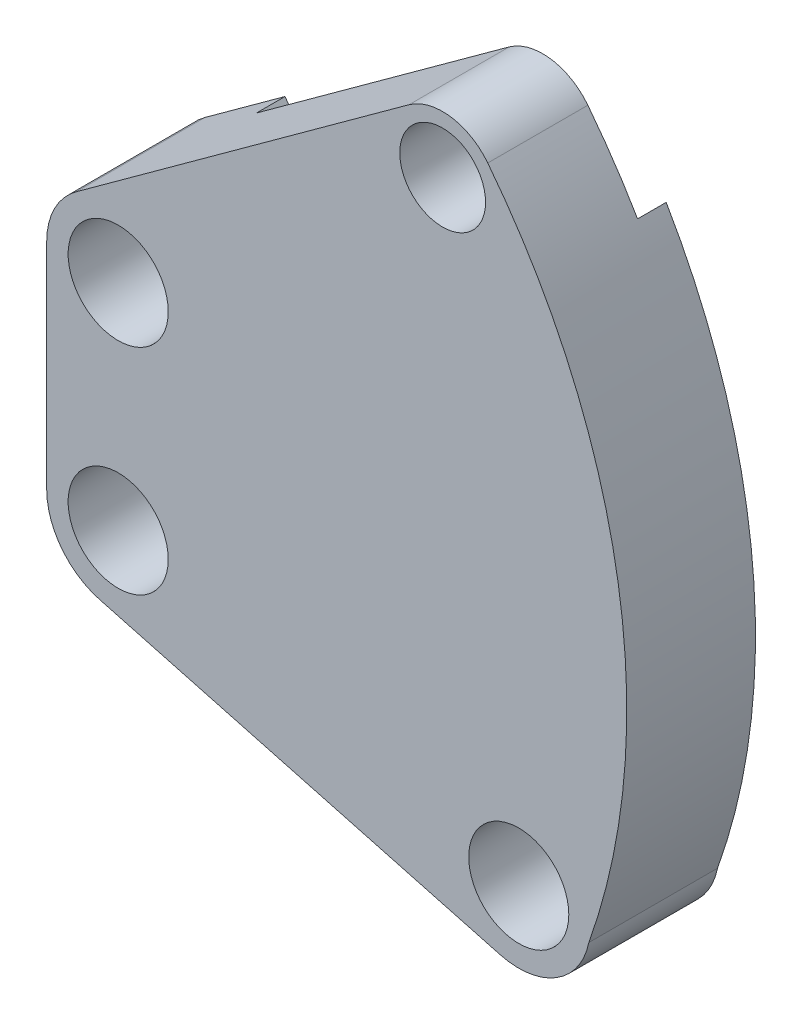
ISO-10303-21;
HEADER;
FILE_DESCRIPTION(('STEP AP214'),'2;1');
FILE_NAME('part.step','',(''),(''),'','','');
FILE_SCHEMA(('AUTOMOTIVE_DESIGN { 1 0 10303 214 1 1 1 1 }'));
ENDSEC;
DATA;
#1=APPLICATION_CONTEXT('core data for automotive mechanical design processes');
#2=APPLICATION_PROTOCOL_DEFINITION('international standard','automotive_design',2000,#1);
#3=PRODUCT_CONTEXT('',#1,'mechanical');
#4=PRODUCT('Part','Part','',(#3));
#5=PRODUCT_RELATED_PRODUCT_CATEGORY('part','',(#4));
#6=PRODUCT_DEFINITION_FORMATION('','',#4);
#7=PRODUCT_DEFINITION_CONTEXT('part definition',#1,'design');
#8=PRODUCT_DEFINITION('design','',#6,#7);
#9=PRODUCT_DEFINITION_SHAPE('','',#8);
#10=(LENGTH_UNIT() NAMED_UNIT(*) SI_UNIT(.MILLI.,.METRE.));
#11=(NAMED_UNIT(*) PLANE_ANGLE_UNIT() SI_UNIT($,.RADIAN.));
#12=(NAMED_UNIT(*) SI_UNIT($,.STERADIAN.) SOLID_ANGLE_UNIT());
#13=UNCERTAINTY_MEASURE_WITH_UNIT(LENGTH_MEASURE(1.E-05),#10,'distance_accuracy_value','');
#14=(GEOMETRIC_REPRESENTATION_CONTEXT(3) GLOBAL_UNCERTAINTY_ASSIGNED_CONTEXT((#13)) GLOBAL_UNIT_ASSIGNED_CONTEXT((#10,
#11,#12)) REPRESENTATION_CONTEXT('',''));
#15=CARTESIAN_POINT('',(0.,0.,0.));
#16=DIRECTION('',(0.,0.,1.));
#17=DIRECTION('',(1.,0.,0.));
#18=AXIS2_PLACEMENT_3D('',#15,#16,#17);
#19=CARTESIAN_POINT('',(-22.6524758424985,-16.4579870641893,-14.));
#20=DIRECTION('',(0.,0.,-1.));
#21=DIRECTION('',(-1.,0.,0.));
#22=AXIS2_PLACEMENT_3D('',#19,#20,#21);
#23=PLANE('',#22);
#24=CARTESIAN_POINT('',(-22.6524758424985,-16.4579870641893,-14.));
#25=DIRECTION('',(0.,0.,1.));
#26=DIRECTION('',(1.,0.,0.));
#27=AXIS2_PLACEMENT_3D('',#24,#25,#26);
#28=CIRCLE('',#27,3.49999999999999);
#29=CARTESIAN_POINT('',(-19.1524758424986,-16.4579870641893,-14.));
#30=VERTEX_POINT('',#29);
#31=EDGE_CURVE('E590',#30,#30,#28,.T.);
#32=ORIENTED_EDGE('',*,*,#31,.T.);
#33=EDGE_LOOP('',(#32));
#34=FACE_BOUND('',#33,.T.);
#35=CARTESIAN_POINT('',(-22.6524758424985,-31.4579870641893,-14.));
#36=DIRECTION('',(0.,0.,1.));
#37=DIRECTION('',(1.,0.,0.));
#38=AXIS2_PLACEMENT_3D('',#35,#36,#37);
#39=CIRCLE('',#38,3.49999999999999);
#40=CARTESIAN_POINT('',(-19.1524758424986,-31.4579870641893,-14.));
#41=VERTEX_POINT('',#40);
#42=EDGE_CURVE('E584',#41,#41,#39,.T.);
#43=ORIENTED_EDGE('',*,*,#42,.T.);
#44=EDGE_LOOP('',(#43));
#45=FACE_BOUND('',#44,.T.);
#46=DIRECTION('',(0.,1.,0.));
#47=VECTOR('',#46,1.);
#48=CARTESIAN_POINT('',(-27.6524758424986,-35.294622004084,-14.));
#49=LINE('',#48,#47);
#50=CARTESIAN_POINT('',(-27.6524758424986,-31.4579870641893,-14.));
#51=VERTEX_POINT('',#50);
#52=CARTESIAN_POINT('',(-27.6524758424986,-16.4579870641893,-14.));
#53=VERTEX_POINT('',#52);
#54=EDGE_CURVE('E366',#51,#53,#49,.T.);
#55=ORIENTED_EDGE('',*,*,#54,.T.);
#56=CARTESIAN_POINT('',(-22.6524758424986,-16.4579870641893,-14.));
#57=DIRECTION('',(0.,0.,-1.));
#58=DIRECTION('',(-1.,0.,0.));
#59=AXIS2_PLACEMENT_3D('',#56,#57,#58);
#60=CIRCLE('',#59,5.);
#61=CARTESIAN_POINT('',(-25.5914021039609,-12.4129020923145,-14.));
#62=VERTEX_POINT('',#61);
#63=EDGE_CURVE('E343',#53,#62,#60,.T.);
#64=ORIENTED_EDGE('',*,*,#63,.T.);
#65=DIRECTION('',(0.809016994374947,0.587785252292474,0.));
#66=VECTOR('',#65,1.);
#67=CARTESIAN_POINT('',(-27.6524758424986,-13.9103598167171,-14.));
#68=LINE('',#67,#66);
#69=CARTESIAN_POINT('',(-19.9863679501846,-8.3406064086735,-14.));
#70=VERTEX_POINT('',#69);
#71=EDGE_CURVE('E365',#62,#70,#68,.T.);
#72=ORIENTED_EDGE('',*,*,#71,.T.);
#73=DIRECTION('',(0.587785252292464,-0.809016994374954,0.));
#74=VECTOR('',#73,1.);
#75=CARTESIAN_POINT('',(-19.9863679501846,-8.3406064086735,-14.));
#76=LINE('',#75,#74);
#77=CARTESIAN_POINT('',(-18.8107974455997,-9.9586403974234,-14.));
#78=VERTEX_POINT('',#77);
#79=EDGE_CURVE('E371',#70,#78,#76,.T.);
#80=ORIENTED_EDGE('',*,*,#79,.T.);
#81=CARTESIAN_POINT('',(-17.6352269410147,-11.5766743861733,-14.));
#82=DIRECTION('',(0.,0.,-1.));
#83=DIRECTION('',(-1.,0.,0.));
#84=AXIS2_PLACEMENT_3D('',#81,#82,#83);
#85=CIRCLE('',#84,2.);
#86=CARTESIAN_POINT('',(-19.068726627153,-12.9713351513207,-14.));
#87=VERTEX_POINT('',#86);
#88=EDGE_CURVE('E334',#78,#87,#85,.F.);
#89=ORIENTED_EDGE('',*,*,#88,.T.);
#90=CARTESIAN_POINT('',(-22.6524758424985,-16.4579870641893,-14.));
#91=DIRECTION('',(0.,0.,-1.));
#92=DIRECTION('',(-1.,0.,0.));
#93=AXIS2_PLACEMENT_3D('',#90,#91,#92);
#94=CIRCLE('',#93,5.);
#95=CARTESIAN_POINT('',(-23.3667615567843,-21.4067036572432,-14.));
#96=VERTEX_POINT('',#95);
#97=EDGE_CURVE('E374',#87,#96,#94,.T.);
#98=ORIENTED_EDGE('',*,*,#97,.T.);
#99=CARTESIAN_POINT('',(-23.6524758424985,-23.3861902944648,-14.));
#100=DIRECTION('',(0.,0.,-1.));
#101=DIRECTION('',(-1.,0.,0.));
#102=AXIS2_PLACEMENT_3D('',#99,#100,#101);
#103=CIRCLE('',#102,2.);
#104=CARTESIAN_POINT('',(-25.6524758424985,-23.3861902944648,-14.));
#105=VERTEX_POINT('',#104);
#106=EDGE_CURVE('E330',#96,#105,#103,.F.);
#107=ORIENTED_EDGE('',*,*,#106,.T.);
#108=DIRECTION('',(0.,-1.,0.));
#109=VECTOR('',#108,1.);
#110=CARTESIAN_POINT('',(-25.6524758424985,-20.4579870641892,-14.));
#111=LINE('',#110,#109);
#112=CARTESIAN_POINT('',(-25.6524758424985,-24.5297838339137,-14.));
#113=VERTEX_POINT('',#112);
#114=EDGE_CURVE('E383',#105,#113,#111,.T.);
#115=ORIENTED_EDGE('',*,*,#114,.T.);
#116=CARTESIAN_POINT('',(-23.6524758424985,-24.5297838339137,-14.));
#117=DIRECTION('',(0.,0.,-1.));
#118=DIRECTION('',(-1.,0.,0.));
#119=AXIS2_PLACEMENT_3D('',#116,#117,#118);
#120=CIRCLE('',#119,2.);
#121=CARTESIAN_POINT('',(-23.3667615567843,-26.5092704711353,-14.));
#122=VERTEX_POINT('',#121);
#123=EDGE_CURVE('E324',#113,#122,#120,.F.);
#124=ORIENTED_EDGE('',*,*,#123,.T.);
#125=CARTESIAN_POINT('',(-22.6524758424985,-31.4579870641893,-14.));
#126=DIRECTION('',(0.,0.,-1.));
#127=DIRECTION('',(-1.,0.,0.));
#128=AXIS2_PLACEMENT_3D('',#125,#126,#127);
#129=CIRCLE('',#128,5.);
#130=CARTESIAN_POINT('',(-18.0572534247843,-33.4287561860644,-14.));
#131=VERTEX_POINT('',#130);
#132=EDGE_CURVE('E386',#122,#131,#129,.T.);
#133=ORIENTED_EDGE('',*,*,#132,.T.);
#134=CARTESIAN_POINT('',(-16.2191644576986,-34.2170638348144,-14.));
#135=DIRECTION('',(0.,0.,-1.));
#136=DIRECTION('',(-1.,0.,0.));
#137=AXIS2_PLACEMENT_3D('',#134,#135,#136);
#138=CIRCLE('',#137,2.);
#139=CARTESIAN_POINT('',(-16.7368025479036,-36.1489154873926,-14.));
#140=VERTEX_POINT('',#139);
#141=EDGE_CURVE('E326',#131,#140,#138,.F.);
#142=ORIENTED_EDGE('',*,*,#141,.T.);
#143=DIRECTION('',(0.965925826289069,-0.25881904510252,0.));
#144=VECTOR('',#143,1.);
#145=CARTESIAN_POINT('',(-19.5652296726498,-35.3910407234665,-14.));
#146=LINE('',#145,#144);
#147=CARTESIAN_POINT('',(-2.10921444532555,-40.0683659066934,-14.));
#148=VERTEX_POINT('',#147);
#149=EDGE_CURVE('E389',#140,#148,#146,.T.);
#150=ORIENTED_EDGE('',*,*,#149,.T.);
#151=CARTESIAN_POINT('',(-1.59157635512051,-38.1365142541153,-14.));
#152=DIRECTION('',(0.,0.,-1.));
#153=DIRECTION('',(-1.,0.,0.));
#154=AXIS2_PLACEMENT_3D('',#151,#152,#153);
#155=CIRCLE('',#154,2.);
#156=CARTESIAN_POINT('',(0.394409209166627,-38.372864287843,-14.));
#157=VERTEX_POINT('',#156);
#158=EDGE_CURVE('E322',#148,#157,#155,.F.);
#159=ORIENTED_EDGE('',*,*,#158,.T.);
#160=CARTESIAN_POINT('',(5.35937311988446,-38.9637393721623,-14.));
#161=DIRECTION('',(0.,0.,-1.));
#162=DIRECTION('',(-1.,0.,0.));
#163=AXIS2_PLACEMENT_3D('',#160,#161,#162);
#164=CIRCLE('',#163,4.99999999999999);
#165=CARTESIAN_POINT('',(7.35080992285406,-34.3774359086115,-14.));
#166=VERTEX_POINT('',#165);
#167=EDGE_CURVE('E392',#157,#166,#164,.T.);
#168=ORIENTED_EDGE('',*,*,#167,.T.);
#169=CARTESIAN_POINT('',(8.1473846440419,-32.5429145231912,-14.));
#170=DIRECTION('',(0.,0.,-1.));
#171=DIRECTION('',(-1.,0.,0.));
#172=AXIS2_PLACEMENT_3D('',#169,#170,#171);
#173=CIRCLE('',#172,2.);
#174=CARTESIAN_POINT('',(10.1109107981021,-32.923131622125,-14.));
#175=VERTEX_POINT('',#174);
#176=EDGE_CURVE('E332',#166,#175,#173,.F.);
#177=ORIENTED_EDGE('',*,*,#176,.T.);
#178=CARTESIAN_POINT('',(-33.086664591222,-24.5583554455818,-14.));
#179=DIRECTION('',(0.,0.,1.));
#180=DIRECTION('',(1.,0.,0.));
#181=AXIS2_PLACEMENT_3D('',#178,#179,#180);
#182=CIRCLE('',#181,44.);
#183=CARTESIAN_POINT('',(6.11949722855625,-4.58645329878153,-14.));
#184=VERTEX_POINT('',#183);
#185=EDGE_CURVE('E395',#175,#184,#182,.T.);
#186=ORIENTED_EDGE('',*,*,#185,.T.);
#187=CARTESIAN_POINT('',(1.73025928211613,-2.1917528478837,-14.));
#188=DIRECTION('',(0.,0.,1.));
#189=DIRECTION('',(1.,0.,0.));
#190=AXIS2_PLACEMENT_3D('',#187,#188,#189);
#191=CIRCLE('',#190,5.00000000000001);
#192=CARTESIAN_POINT('',(6.67035341824604,-1.42008586908067,-14.));
#193=VERTEX_POINT('',#192);
#194=EDGE_CURVE('E251',#184,#193,#191,.T.);
#195=ORIENTED_EDGE('',*,*,#194,.T.);
#196=CARTESIAN_POINT('',(-33.086664591222,-24.5583554455818,-14.));
#197=DIRECTION('',(0.,0.,-1.));
#198=DIRECTION('',(-1.,0.,0.));
#199=AXIS2_PLACEMENT_3D('',#196,#197,#198);
#200=CIRCLE('',#199,46.);
#201=CARTESIAN_POINT('',(10.2601455915492,-39.9549150281252,-14.));
#202=VERTEX_POINT('',#201);
#203=EDGE_CURVE('E398',#193,#202,#200,.T.);
#204=ORIENTED_EDGE('',*,*,#203,.T.);
#205=CARTESIAN_POINT('',(5.35937311988446,-38.9637393721623,-14.));
#206=DIRECTION('',(0.,0.,-1.));
#207=DIRECTION('',(-1.,0.,0.));
#208=AXIS2_PLACEMENT_3D('',#205,#206,#207);
#209=CIRCLE('',#208,5.00000000000001);
#210=CARTESIAN_POINT('',(4.06527789437187,-43.7933685036077,-14.));
#211=VERTEX_POINT('',#210);
#212=EDGE_CURVE('E401',#202,#211,#209,.T.);
#213=ORIENTED_EDGE('',*,*,#212,.T.);
#214=DIRECTION('',(-0.965925826289068,0.258819045102521,0.));
#215=VECTOR('',#214,1.);
#216=CARTESIAN_POINT('',(4.06527789437187,-43.7933685036077,-14.));
#217=LINE('',#216,#215);
#218=CARTESIAN_POINT('',(-23.9465710680112,-36.2876161956346,-14.));
#219=VERTEX_POINT('',#218);
#220=EDGE_CURVE('E404',#211,#219,#217,.T.);
#221=ORIENTED_EDGE('',*,*,#220,.T.);
#222=CARTESIAN_POINT('',(-22.6524758424986,-31.4579870641893,-14.));
#223=DIRECTION('',(0.,0.,-1.));
#224=DIRECTION('',(-1.,0.,0.));
#225=AXIS2_PLACEMENT_3D('',#222,#223,#224);
#226=CIRCLE('',#225,5.);
#227=EDGE_CURVE('E341',#219,#51,#226,.T.);
#228=ORIENTED_EDGE('',*,*,#227,.T.);
#229=EDGE_LOOP('',(#55,#64,#72,#80,#89,#98,#107,#115,#124,#133,#142,#150,#159,#168,#177,#186,
#195,#204,#213,#221,#228));
#230=FACE_BOUND('',#229,.T.);
#231=CARTESIAN_POINT('',(5.35937311988447,-38.9637393721623,-14.));
#232=DIRECTION('',(0.,0.,1.));
#233=DIRECTION('',(1.,0.,0.));
#234=AXIS2_PLACEMENT_3D('',#231,#232,#233);
#235=CIRCLE('',#234,3.49999999999999);
#236=CARTESIAN_POINT('',(8.85937311988446,-38.9637393721623,-14.));
#237=VERTEX_POINT('',#236);
#238=EDGE_CURVE('E454',#237,#237,#235,.T.);
#239=ORIENTED_EDGE('',*,*,#238,.T.);
#240=EDGE_LOOP('',(#239));
#241=FACE_BOUND('',#240,.T.);
#242=ADVANCED_FACE('F39',(#34,#45,#230,#241),#23,.T.);
#243=CARTESIAN_POINT('',(-27.6524758424986,-13.9103598167171,-12.));
#244=DIRECTION('',(-0.587785252292474,0.809016994374947,0.));
#245=DIRECTION('',(-0.809016994374947,-0.587785252292474,0.));
#246=AXIS2_PLACEMENT_3D('',#243,#244,#245);
#247=PLANE('',#246);
#248=ORIENTED_EDGE('',*,*,#71,.F.);
#249=DIRECTION('',(0.,0.,-1.));
#250=VECTOR('',#249,1.);
#251=CARTESIAN_POINT('',(-25.5914021039609,-12.4129020923145,-12.));
#252=LINE('',#251,#250);
#253=CARTESIAN_POINT('',(-25.5914021039609,-12.4129020923145,-5.00000000000001));
#254=VERTEX_POINT('',#253);
#255=EDGE_CURVE('E62',#62,#254,#252,.F.);
#256=ORIENTED_EDGE('',*,*,#255,.T.);
#257=DIRECTION('',(-0.809016994374947,-0.587785252292474,0.));
#258=VECTOR('',#257,1.);
#259=CARTESIAN_POINT('',(-27.6524758424986,-13.9103598167171,-5.00000000000001));
#260=LINE('',#259,#258);
#261=CARTESIAN_POINT('',(-2.31334090109592,4.49959934107852,-5.00000000000001));
#262=VERTEX_POINT('',#261);
#263=EDGE_CURVE('E350',#262,#254,#260,.T.);
#264=ORIENTED_EDGE('',*,*,#263,.F.);
#265=DIRECTION('',(0.,0.,-1.));
#266=VECTOR('',#265,1.);
#267=CARTESIAN_POINT('',(-2.31334090109592,4.49959934107852,-5.00000000000001));
#268=LINE('',#267,#266);
#269=CARTESIAN_POINT('',(-2.31334090109592,4.49959934107852,-12.));
#270=VERTEX_POINT('',#269);
#271=EDGE_CURVE('E377',#262,#270,#268,.T.);
#272=ORIENTED_EDGE('',*,*,#271,.T.);
#273=DIRECTION('',(-0.809016994374947,-0.587785252292474,0.));
#274=VECTOR('',#273,1.);
#275=CARTESIAN_POINT('',(-27.6524758424986,-13.9103598167171,-12.));
#276=LINE('',#275,#274);
#277=CARTESIAN_POINT('',(-19.9863679501846,-8.3406064086735,-12.));
#278=VERTEX_POINT('',#277);
#279=EDGE_CURVE('E359',#270,#278,#276,.T.);
#280=ORIENTED_EDGE('',*,*,#279,.T.);
#281=DIRECTION('',(0.,0.,-1.));
#282=VECTOR('',#281,1.);
#283=CARTESIAN_POINT('',(-19.9863679501846,-8.3406064086735,-12.));
#284=LINE('',#283,#282);
#285=EDGE_CURVE('E246',#278,#70,#284,.T.);
#286=ORIENTED_EDGE('',*,*,#285,.T.);
#287=EDGE_LOOP('',(#248,#256,#264,#272,#280,#286));
#288=FACE_BOUND('',#287,.T.);
#289=ADVANCED_FACE('F367',(#288),#247,.T.);
#290=CARTESIAN_POINT('',(-27.6524758424986,-35.294622004084,-12.));
#291=DIRECTION('',(-1.,0.,0.));
#292=DIRECTION('',(0.,-1.,0.));
#293=AXIS2_PLACEMENT_3D('',#290,#291,#292);
#294=PLANE('',#293);
#295=DIRECTION('',(0.,-1.,0.));
#296=VECTOR('',#295,1.);
#297=CARTESIAN_POINT('',(-27.6524758424986,-35.294622004084,-5.00000000000001));
#298=LINE('',#297,#296);
#299=CARTESIAN_POINT('',(-27.6524758424986,-16.4579870641893,-5.00000000000001));
#300=VERTEX_POINT('',#299);
#301=CARTESIAN_POINT('',(-27.6524758424986,-31.4579870641893,-5.00000000000001));
#302=VERTEX_POINT('',#301);
#303=EDGE_CURVE('E349',#300,#302,#298,.T.);
#304=ORIENTED_EDGE('',*,*,#303,.F.);
#305=DIRECTION('',(0.,0.,-1.));
#306=VECTOR('',#305,1.);
#307=CARTESIAN_POINT('',(-27.6524758424986,-16.4579870641893,-12.));
#308=LINE('',#307,#306);
#309=EDGE_CURVE('E338',#300,#53,#308,.T.);
#310=ORIENTED_EDGE('',*,*,#309,.T.);
#311=ORIENTED_EDGE('',*,*,#54,.F.);
#312=DIRECTION('',(0.,0.,-1.));
#313=VECTOR('',#312,1.);
#314=CARTESIAN_POINT('',(-27.6524758424986,-31.4579870641893,-12.));
#315=LINE('',#314,#313);
#316=EDGE_CURVE('E336',#51,#302,#315,.F.);
#317=ORIENTED_EDGE('',*,*,#316,.T.);
#318=EDGE_LOOP('',(#304,#310,#311,#317));
#319=FACE_BOUND('',#318,.T.);
#320=ADVANCED_FACE('F354',(#319),#294,.T.);
#321=CARTESIAN_POINT('',(4.06527789437187,-43.7933685036077,-12.));
#322=DIRECTION('',(-0.258819045102521,-0.965925826289068,0.));
#323=DIRECTION('',(0.965925826289068,-0.258819045102521,0.));
#324=AXIS2_PLACEMENT_3D('',#321,#322,#323);
#325=PLANE('',#324);
#326=DIRECTION('',(0.965925826289068,-0.25881904510252,0.));
#327=VECTOR('',#326,1.);
#328=CARTESIAN_POINT('',(4.06527789437186,-43.7933685036077,-5.00000000000001));
#329=LINE('',#328,#327);
#330=CARTESIAN_POINT('',(-23.9465710680112,-36.2876161956346,-5.00000000000001));
#331=VERTEX_POINT('',#330);
#332=CARTESIAN_POINT('',(4.06527789437186,-43.7933685036077,-5.00000000000001));
#333=VERTEX_POINT('',#332);
#334=EDGE_CURVE('E358',#331,#333,#329,.T.);
#335=ORIENTED_EDGE('',*,*,#334,.F.);
#336=DIRECTION('',(0.,0.,-1.));
#337=VECTOR('',#336,1.);
#338=CARTESIAN_POINT('',(-23.9465710680112,-36.2876161956346,-12.));
#339=LINE('',#338,#337);
#340=EDGE_CURVE('E11',#331,#219,#339,.T.);
#341=ORIENTED_EDGE('',*,*,#340,.T.);
#342=ORIENTED_EDGE('',*,*,#220,.F.);
#343=DIRECTION('',(0.,0.,-1.));
#344=VECTOR('',#343,1.);
#345=CARTESIAN_POINT('',(4.06527789437187,-43.7933685036077,-12.));
#346=LINE('',#345,#344);
#347=EDGE_CURVE('E266',#333,#211,#346,.T.);
#348=ORIENTED_EDGE('',*,*,#347,.F.);
#349=EDGE_LOOP('',(#335,#341,#342,#348));
#350=FACE_BOUND('',#349,.T.);
#351=ADVANCED_FACE('F479',(#350),#325,.T.);
#352=CARTESIAN_POINT('',(5.35937311988446,-38.9637393721623,-12.));
#353=DIRECTION('',(0.,0.,-1.));
#354=DIRECTION('',(-1.,0.,0.));
#355=AXIS2_PLACEMENT_3D('',#352,#353,#354);
#356=CYLINDRICAL_SURFACE('',#355,5.00000000000001);
#357=ORIENTED_EDGE('',*,*,#212,.F.);
#358=DIRECTION('',(0.,0.,-1.));
#359=VECTOR('',#358,1.);
#360=CARTESIAN_POINT('',(10.2601455915492,-39.9549150281252,-12.));
#361=LINE('',#360,#359);
#362=CARTESIAN_POINT('',(10.2601455915492,-39.9549150281252,-5.00000000000001));
#363=VERTEX_POINT('',#362);
#364=EDGE_CURVE('E255',#363,#202,#361,.T.);
#365=ORIENTED_EDGE('',*,*,#364,.F.);
#366=CARTESIAN_POINT('',(5.35937311988446,-38.9637393721623,-5.00000000000001));
#367=DIRECTION('',(0.,0.,1.));
#368=DIRECTION('',(-1.,0.,0.));
#369=AXIS2_PLACEMENT_3D('',#366,#367,#368);
#370=CIRCLE('',#369,5.);
#371=EDGE_CURVE('E457',#333,#363,#370,.T.);
#372=ORIENTED_EDGE('',*,*,#371,.F.);
#373=ORIENTED_EDGE('',*,*,#347,.T.);
#374=EDGE_LOOP('',(#357,#365,#372,#373));
#375=FACE_BOUND('',#374,.T.);
#376=ADVANCED_FACE('F418',(#375),#356,.T.);
#377=CARTESIAN_POINT('',(-33.086664591222,-24.5583554455818,-12.));
#378=DIRECTION('',(0.,0.,-1.));
#379=DIRECTION('',(-1.,0.,0.));
#380=AXIS2_PLACEMENT_3D('',#377,#378,#379);
#381=CYLINDRICAL_SURFACE('',#380,46.);
#382=ORIENTED_EDGE('',*,*,#203,.F.);
#383=DIRECTION('',(0.,0.,-1.));
#384=VECTOR('',#383,1.);
#385=CARTESIAN_POINT('',(6.67035341824604,-1.42008586908067,-12.));
#386=LINE('',#385,#384);
#387=CARTESIAN_POINT('',(6.67035341824602,-1.42008586908064,-12.));
#388=VERTEX_POINT('',#387);
#389=EDGE_CURVE('E252',#388,#193,#386,.T.);
#390=ORIENTED_EDGE('',*,*,#389,.F.);
#391=CARTESIAN_POINT('',(-33.086664591222,-24.5583554455818,-12.));
#392=DIRECTION('',(0.,0.,1.));
#393=DIRECTION('',(-1.,0.,0.));
#394=AXIS2_PLACEMENT_3D('',#391,#392,#393);
#395=CIRCLE('',#394,46.0000000000001);
#396=CARTESIAN_POINT('',(3.19251103181644,3.72275867873688,-12.));
#397=VERTEX_POINT('',#396);
#398=EDGE_CURVE('E243',#388,#397,#395,.T.);
#399=ORIENTED_EDGE('',*,*,#398,.T.);
#400=DIRECTION('',(0.,0.,-1.));
#401=VECTOR('',#400,1.);
#402=CARTESIAN_POINT('',(3.19251103181644,3.72275867873688,-5.00000000000001));
#403=LINE('',#402,#401);
#404=CARTESIAN_POINT('',(3.19251103181644,3.72275867873688,-5.00000000000001));
#405=VERTEX_POINT('',#404);
#406=EDGE_CURVE('E372',#405,#397,#403,.T.);
#407=ORIENTED_EDGE('',*,*,#406,.F.);
#408=CARTESIAN_POINT('',(-33.086664591222,-24.5583554455818,-5.00000000000001));
#409=DIRECTION('',(0.,0.,1.));
#410=DIRECTION('',(-1.,0.,0.));
#411=AXIS2_PLACEMENT_3D('',#408,#409,#410);
#412=CIRCLE('',#411,46.0000000000001);
#413=EDGE_CURVE('E414',#363,#405,#412,.T.);
#414=ORIENTED_EDGE('',*,*,#413,.F.);
#415=ORIENTED_EDGE('',*,*,#364,.T.);
#416=EDGE_LOOP('',(#382,#390,#399,#407,#414,#415));
#417=FACE_BOUND('',#416,.T.);
#418=ADVANCED_FACE('F412',(#417),#381,.T.);
#419=CARTESIAN_POINT('',(1.73025928211613,-2.1917528478837,-12.));
#420=DIRECTION('',(0.,0.,-1.));
#421=DIRECTION('',(-1.,0.,0.));
#422=AXIS2_PLACEMENT_3D('',#419,#420,#421);
#423=CYLINDRICAL_SURFACE('',#422,5.00000000000001);
#424=ORIENTED_EDGE('',*,*,#194,.F.);
#425=DIRECTION('',(0.,0.,-1.));
#426=VECTOR('',#425,1.);
#427=CARTESIAN_POINT('',(6.11949722855625,-4.58645329878153,-12.));
#428=LINE('',#427,#426);
#429=CARTESIAN_POINT('',(6.11949722855625,-4.58645329878153,-12.));
#430=VERTEX_POINT('',#429);
#431=EDGE_CURVE('E231',#430,#184,#428,.T.);
#432=ORIENTED_EDGE('',*,*,#431,.F.);
#433=CARTESIAN_POINT('',(1.73025928211613,-2.1917528478837,-12.));
#434=DIRECTION('',(0.,0.,1.));
#435=DIRECTION('',(1.,0.,0.));
#436=AXIS2_PLACEMENT_3D('',#433,#434,#435);
#437=CIRCLE('',#436,5.00000000000001);
#438=EDGE_CURVE('E240',#430,#388,#437,.T.);
#439=ORIENTED_EDGE('',*,*,#438,.T.);
#440=ORIENTED_EDGE('',*,*,#389,.T.);
#441=EDGE_LOOP('',(#424,#432,#439,#440));
#442=FACE_BOUND('',#441,.T.);
#443=ADVANCED_FACE('F249',(#442),#423,.F.);
#444=CARTESIAN_POINT('',(-33.086664591222,-24.5583554455818,-12.));
#445=DIRECTION('',(0.,0.,-1.));
#446=DIRECTION('',(-1.,0.,0.));
#447=AXIS2_PLACEMENT_3D('',#444,#445,#446);
#448=CYLINDRICAL_SURFACE('',#447,44.);
#449=CARTESIAN_POINT('',(-33.086664591222,-24.5583554455818,-11.));
#450=DIRECTION('',(0.,0.,-1.));
#451=DIRECTION('',(-1.,0.,0.));
#452=AXIS2_PLACEMENT_3D('',#449,#450,#451);
#453=CIRCLE('',#452,44.);
#454=CARTESIAN_POINT('',(5.62608717983734,-3.64608989848374,-11.));
#455=VERTEX_POINT('',#454);
#456=CARTESIAN_POINT('',(10.1109107981021,-32.923131622125,-11.));
#457=VERTEX_POINT('',#456);
#458=EDGE_CURVE('E434',#455,#457,#453,.T.);
#459=ORIENTED_EDGE('',*,*,#458,.F.);
#460=DIRECTION('',(0.,0.,-1.));
#461=VECTOR('',#460,1.);
#462=CARTESIAN_POINT('',(5.62608717983734,-3.64608989848374,-12.));
#463=LINE('',#462,#461);
#464=CARTESIAN_POINT('',(5.62608717983734,-3.64608989848374,-12.));
#465=VERTEX_POINT('',#464);
#466=EDGE_CURVE('E234',#455,#465,#463,.T.);
#467=ORIENTED_EDGE('',*,*,#466,.T.);
#468=CARTESIAN_POINT('',(-33.086664591222,-24.5583554455818,-12.));
#469=DIRECTION('',(0.,0.,-1.));
#470=DIRECTION('',(-1.,0.,0.));
#471=AXIS2_PLACEMENT_3D('',#468,#469,#470);
#472=CIRCLE('',#471,44.);
#473=EDGE_CURVE('E225',#465,#430,#472,.T.);
#474=ORIENTED_EDGE('',*,*,#473,.T.);
#475=ORIENTED_EDGE('',*,*,#431,.T.);
#476=ORIENTED_EDGE('',*,*,#185,.F.);
#477=DIRECTION('',(0.,0.,-1.));
#478=VECTOR('',#477,1.);
#479=CARTESIAN_POINT('',(10.1109107981021,-32.923131622125,-12.));
#480=LINE('',#479,#478);
#481=EDGE_CURVE('E265',#175,#457,#480,.F.);
#482=ORIENTED_EDGE('',*,*,#481,.T.);
#483=EDGE_LOOP('',(#459,#467,#474,#475,#476,#482));
#484=FACE_BOUND('',#483,.T.);
#485=ADVANCED_FACE('F228',(#484),#448,.F.);
#486=CARTESIAN_POINT('',(5.35937311988446,-38.9637393721623,-12.));
#487=DIRECTION('',(0.,0.,-1.));
#488=DIRECTION('',(-1.,0.,0.));
#489=AXIS2_PLACEMENT_3D('',#486,#487,#488);
#490=CYLINDRICAL_SURFACE('',#489,4.99999999999999);
#491=ORIENTED_EDGE('',*,*,#167,.F.);
#492=DIRECTION('',(0.,0.,-1.));
#493=VECTOR('',#492,1.);
#494=CARTESIAN_POINT('',(0.394409209166627,-38.372864287843,-12.));
#495=LINE('',#494,#493);
#496=CARTESIAN_POINT('',(0.39440920916662,-38.372864287843,-11.));
#497=VERTEX_POINT('',#496);
#498=EDGE_CURVE('E298',#157,#497,#495,.F.);
#499=ORIENTED_EDGE('',*,*,#498,.T.);
#500=CARTESIAN_POINT('',(5.35937311988446,-38.9637393721623,-11.));
#501=DIRECTION('',(0.,0.,1.));
#502=DIRECTION('',(1.,0.,0.));
#503=AXIS2_PLACEMENT_3D('',#500,#501,#502);
#504=CIRCLE('',#503,4.99999999999999);
#505=CARTESIAN_POINT('',(7.35080992285406,-34.3774359086115,-11.));
#506=VERTEX_POINT('',#505);
#507=EDGE_CURVE('E432',#506,#497,#504,.T.);
#508=ORIENTED_EDGE('',*,*,#507,.F.);
#509=DIRECTION('',(0.,0.,-1.));
#510=VECTOR('',#509,1.);
#511=CARTESIAN_POINT('',(7.35080992285406,-34.3774359086115,-12.));
#512=LINE('',#511,#510);
#513=EDGE_CURVE('E295',#506,#166,#512,.T.);
#514=ORIENTED_EDGE('',*,*,#513,.T.);
#515=EDGE_LOOP('',(#491,#499,#508,#514));
#516=FACE_BOUND('',#515,.T.);
#517=ADVANCED_FACE('F437',(#516),#490,.T.);
#518=CARTESIAN_POINT('',(-19.5652296726498,-35.3910407234665,-12.));
#519=DIRECTION('',(0.25881904510252,0.965925826289069,0.));
#520=DIRECTION('',(-0.965925826289069,0.25881904510252,0.));
#521=AXIS2_PLACEMENT_3D('',#518,#519,#520);
#522=PLANE('',#521);
#523=DIRECTION('',(-0.965925826289069,0.25881904510252,0.));
#524=VECTOR('',#523,1.);
#525=CARTESIAN_POINT('',(0.719212679420629,-40.8262406706195,-11.));
#526=LINE('',#525,#524);
#527=CARTESIAN_POINT('',(-2.10921444532555,-40.0683659066934,-11.));
#528=VERTEX_POINT('',#527);
#529=CARTESIAN_POINT('',(-16.7368025479036,-36.1489154873926,-11.));
#530=VERTEX_POINT('',#529);
#531=EDGE_CURVE('E439',#528,#530,#526,.T.);
#532=ORIENTED_EDGE('',*,*,#531,.F.);
#533=DIRECTION('',(0.,0.,1.));
#534=VECTOR('',#533,1.);
#535=CARTESIAN_POINT('',(-2.10921444532555,-40.0683659066934,-14.));
#536=LINE('',#535,#534);
#537=EDGE_CURVE('E292',#528,#148,#536,.F.);
#538=ORIENTED_EDGE('',*,*,#537,.T.);
#539=ORIENTED_EDGE('',*,*,#149,.F.);
#540=DIRECTION('',(0.,0.,1.));
#541=VECTOR('',#540,1.);
#542=CARTESIAN_POINT('',(-16.7368025479036,-36.1489154873926,-11.));
#543=LINE('',#542,#541);
#544=EDGE_CURVE('E290',#140,#530,#543,.T.);
#545=ORIENTED_EDGE('',*,*,#544,.T.);
#546=EDGE_LOOP('',(#532,#538,#539,#545));
#547=FACE_BOUND('',#546,.T.);
#548=ADVANCED_FACE('F513',(#547),#522,.T.);
#549=CARTESIAN_POINT('',(-22.6524758424985,-31.4579870641893,-12.));
#550=DIRECTION('',(0.,0.,-1.));
#551=DIRECTION('',(-1.,0.,0.));
#552=AXIS2_PLACEMENT_3D('',#549,#550,#551);
#553=CYLINDRICAL_SURFACE('',#552,5.);
#554=ORIENTED_EDGE('',*,*,#132,.F.);
#555=DIRECTION('',(0.,0.,-1.));
#556=VECTOR('',#555,1.);
#557=CARTESIAN_POINT('',(-23.3667615567843,-26.5092704711353,-12.));
#558=LINE('',#557,#556);
#559=CARTESIAN_POINT('',(-23.3667615567843,-26.5092704711353,-11.));
#560=VERTEX_POINT('',#559);
#561=EDGE_CURVE('E308',#122,#560,#558,.F.);
#562=ORIENTED_EDGE('',*,*,#561,.T.);
#563=CARTESIAN_POINT('',(-22.6524758424985,-31.4579870641893,-11.));
#564=DIRECTION('',(0.,0.,1.));
#565=DIRECTION('',(1.,0.,0.));
#566=AXIS2_PLACEMENT_3D('',#563,#564,#565);
#567=CIRCLE('',#566,5.);
#568=CARTESIAN_POINT('',(-18.0572534247843,-33.4287561860644,-11.));
#569=VERTEX_POINT('',#568);
#570=EDGE_CURVE('E442',#569,#560,#567,.T.);
#571=ORIENTED_EDGE('',*,*,#570,.F.);
#572=DIRECTION('',(0.,0.,-1.));
#573=VECTOR('',#572,1.);
#574=CARTESIAN_POINT('',(-18.0572534247843,-33.4287561860644,-12.));
#575=LINE('',#574,#573);
#576=EDGE_CURVE('E305',#569,#131,#575,.T.);
#577=ORIENTED_EDGE('',*,*,#576,.T.);
#578=EDGE_LOOP('',(#554,#562,#571,#577));
#579=FACE_BOUND('',#578,.T.);
#580=ADVANCED_FACE('F516',(#579),#553,.T.);
#581=CARTESIAN_POINT('',(-25.6524758424985,-20.4579870641892,-12.));
#582=DIRECTION('',(1.,0.,0.));
#583=DIRECTION('',(0.,0.,-1.));
#584=AXIS2_PLACEMENT_3D('',#581,#582,#583);
#585=PLANE('',#584);
#586=DIRECTION('',(0.,1.,0.));
#587=VECTOR('',#586,1.);
#588=CARTESIAN_POINT('',(-25.6524758424986,-27.4579870641893,-11.));
#589=LINE('',#588,#587);
#590=CARTESIAN_POINT('',(-25.6524758424986,-24.5297838339137,-11.));
#591=VERTEX_POINT('',#590);
#592=CARTESIAN_POINT('',(-25.6524758424985,-23.3861902944648,-11.));
#593=VERTEX_POINT('',#592);
#594=EDGE_CURVE('E450',#591,#593,#589,.T.);
#595=ORIENTED_EDGE('',*,*,#594,.F.);
#596=DIRECTION('',(0.,0.,1.));
#597=VECTOR('',#596,1.);
#598=CARTESIAN_POINT('',(-25.6524758424985,-24.5297838339137,-14.));
#599=LINE('',#598,#597);
#600=EDGE_CURVE('E302',#591,#113,#599,.F.);
#601=ORIENTED_EDGE('',*,*,#600,.T.);
#602=ORIENTED_EDGE('',*,*,#114,.F.);
#603=DIRECTION('',(0.,0.,1.));
#604=VECTOR('',#603,1.);
#605=CARTESIAN_POINT('',(-25.6524758424985,-23.3861902944648,-11.));
#606=LINE('',#605,#604);
#607=EDGE_CURVE('E300',#105,#593,#606,.T.);
#608=ORIENTED_EDGE('',*,*,#607,.T.);
#609=EDGE_LOOP('',(#595,#601,#602,#608));
#610=FACE_BOUND('',#609,.T.);
#611=ADVANCED_FACE('F520',(#610),#585,.T.);
#612=CARTESIAN_POINT('',(-22.6524758424985,-16.4579870641893,-12.));
#613=DIRECTION('',(0.,0.,-1.));
#614=DIRECTION('',(-1.,0.,0.));
#615=AXIS2_PLACEMENT_3D('',#612,#613,#614);
#616=CYLINDRICAL_SURFACE('',#615,5.);
#617=CARTESIAN_POINT('',(-22.6524758424985,-16.4579870641893,-11.));
#618=DIRECTION('',(0.,0.,1.));
#619=DIRECTION('',(1.,0.,0.));
#620=AXIS2_PLACEMENT_3D('',#617,#618,#619);
#621=CIRCLE('',#620,5.);
#622=CARTESIAN_POINT('',(-23.3667615567843,-21.4067036572432,-11.));
#623=VERTEX_POINT('',#622);
#624=CARTESIAN_POINT('',(-19.068726627153,-12.9713351513207,-11.));
#625=VERTEX_POINT('',#624);
#626=EDGE_CURVE('E236',#623,#625,#621,.T.);
#627=ORIENTED_EDGE('',*,*,#626,.F.);
#628=DIRECTION('',(0.,0.,-1.));
#629=VECTOR('',#628,1.);
#630=CARTESIAN_POINT('',(-23.3667615567843,-21.4067036572432,-12.));
#631=LINE('',#630,#629);
#632=EDGE_CURVE('E317',#623,#96,#631,.T.);
#633=ORIENTED_EDGE('',*,*,#632,.T.);
#634=ORIENTED_EDGE('',*,*,#97,.F.);
#635=DIRECTION('',(0.,0.,-1.));
#636=VECTOR('',#635,1.);
#637=CARTESIAN_POINT('',(-19.068726627153,-12.9713351513207,-12.));
#638=LINE('',#637,#636);
#639=EDGE_CURVE('E315',#87,#625,#638,.F.);
#640=ORIENTED_EDGE('',*,*,#639,.T.);
#641=EDGE_LOOP('',(#627,#633,#634,#640));
#642=FACE_BOUND('',#641,.T.);
#643=ADVANCED_FACE('F524',(#642),#616,.T.);
#644=CARTESIAN_POINT('',(-18.8107974455997,-9.9586403974234,-12.));
#645=DIRECTION('',(0.587785252292474,-0.809016994374947,0.));
#646=DIRECTION('',(0.809016994374947,0.587785252292474,0.));
#647=AXIS2_PLACEMENT_3D('',#644,#645,#646);
#648=PLANE('',#647);
#649=DIRECTION('',(0.809016994374947,0.587785252292474,0.));
#650=VECTOR('',#649,1.);
#651=CARTESIAN_POINT('',(-1.137770396511,2.88156535232865,-12.));
#652=LINE('',#651,#650);
#653=CARTESIAN_POINT('',(-18.8107974455997,-9.9586403974234,-12.));
#654=VERTEX_POINT('',#653);
#655=CARTESIAN_POINT('',(-6.80088935713562,-1.23293141371867,-12.));
#656=VERTEX_POINT('',#655);
#657=EDGE_CURVE('E262',#654,#656,#652,.T.);
#658=ORIENTED_EDGE('',*,*,#657,.T.);
#659=DIRECTION('',(0.,0.,-1.));
#660=VECTOR('',#659,1.);
#661=CARTESIAN_POINT('',(-6.80088935713562,-1.23293141371867,-12.));
#662=LINE('',#661,#660);
#663=CARTESIAN_POINT('',(-6.80088935713562,-1.23293141371867,-11.));
#664=VERTEX_POINT('',#663);
#665=EDGE_CURVE('E313',#656,#664,#662,.F.);
#666=ORIENTED_EDGE('',*,*,#665,.T.);
#667=DIRECTION('',(0.809016994374947,0.587785252292474,0.));
#668=VECTOR('',#667,1.);
#669=CARTESIAN_POINT('',(-21.1797636218762,-11.6797950718945,-11.));
#670=LINE('',#669,#668);
#671=CARTESIAN_POINT('',(-18.8107974455997,-9.9586403974234,-11.));
#672=VERTEX_POINT('',#671);
#673=EDGE_CURVE('E572',#672,#664,#670,.T.);
#674=ORIENTED_EDGE('',*,*,#673,.F.);
#675=DIRECTION('',(0.,0.,1.));
#676=VECTOR('',#675,1.);
#677=CARTESIAN_POINT('',(-18.8107974455997,-9.9586403974234,-14.));
#678=LINE('',#677,#676);
#679=EDGE_CURVE('E310',#672,#654,#678,.F.);
#680=ORIENTED_EDGE('',*,*,#679,.T.);
#681=EDGE_LOOP('',(#658,#666,#674,#680));
#682=FACE_BOUND('',#681,.T.);
#683=ADVANCED_FACE('F528',(#682),#648,.T.);
#684=CARTESIAN_POINT('',(-19.9863679501846,-8.3406064086735,-12.));
#685=DIRECTION('',(0.809016994374954,0.587785252292464,0.));
#686=DIRECTION('',(-0.587785252292464,0.809016994374954,0.));
#687=AXIS2_PLACEMENT_3D('',#684,#685,#686);
#688=PLANE('',#687);
#689=ORIENTED_EDGE('',*,*,#79,.F.);
#690=ORIENTED_EDGE('',*,*,#285,.F.);
#691=DIRECTION('',(0.587785252292464,-0.809016994374954,0.));
#692=VECTOR('',#691,1.);
#693=CARTESIAN_POINT('',(-19.9863679501846,-8.3406064086735,-12.));
#694=LINE('',#693,#692);
#695=EDGE_CURVE('E247',#278,#654,#694,.T.);
#696=ORIENTED_EDGE('',*,*,#695,.T.);
#697=DIRECTION('',(0.,0.,-1.));
#698=VECTOR('',#697,1.);
#699=CARTESIAN_POINT('',(-18.8107974455997,-9.9586403974234,-12.));
#700=LINE('',#699,#698);
#701=EDGE_CURVE('E253',#654,#78,#700,.T.);
#702=ORIENTED_EDGE('',*,*,#701,.T.);
#703=EDGE_LOOP('',(#689,#690,#696,#702));
#704=FACE_BOUND('',#703,.T.);
#705=ADVANCED_FACE('F470',(#704),#688,.T.);
#706=CARTESIAN_POINT('',(0.0378001080739705,1.26353136357874,-12.));
#707=DIRECTION('',(0.,0.,-1.));
#708=DIRECTION('',(-1.,0.,0.));
#709=AXIS2_PLACEMENT_3D('',#706,#707,#708);
#710=PLANE('',#709);
#711=CARTESIAN_POINT('',(0.0378001080739705,1.26353136357874,-12.));
#712=DIRECTION('',(0.,0.,-1.));
#713=DIRECTION('',(-1.,0.,0.));
#714=AXIS2_PLACEMENT_3D('',#711,#712,#713);
#715=CIRCLE('',#714,2.99999999999999);
#716=CARTESIAN_POINT('',(-2.96219989192602,1.26353136357874,-12.));
#717=VERTEX_POINT('',#716);
#718=EDGE_CURVE('E595',#717,#717,#715,.T.);
#719=ORIENTED_EDGE('',*,*,#718,.F.);
#720=EDGE_LOOP('',(#719));
#721=FACE_BOUND('',#720,.T.);
#722=ORIENTED_EDGE('',*,*,#473,.F.);
#723=CARTESIAN_POINT('',(3.86641664478919,-4.59664742335184,-12.));
#724=DIRECTION('',(0.,0.,-1.));
#725=DIRECTION('',(-1.,0.,0.));
#726=AXIS2_PLACEMENT_3D('',#723,#724,#725);
#727=CIRCLE('',#726,2.);
#728=CARTESIAN_POINT('',(2.77252620572769,-2.92231062708594,-12.));
#729=VERTEX_POINT('',#728);
#730=EDGE_CURVE('E320',#465,#729,#727,.F.);
#731=ORIENTED_EDGE('',*,*,#730,.T.);
#732=CARTESIAN_POINT('',(0.0378001080739705,1.26353136357874,-12.));
#733=DIRECTION('',(0.,0.,1.));
#734=DIRECTION('',(-1.,0.,0.));
#735=AXIS2_PLACEMENT_3D('',#732,#733,#734);
#736=CIRCLE('',#735,5.);
#737=CARTESIAN_POINT('',(-4.00728486380078,-1.67539489788362,-12.));
#738=VERTEX_POINT('',#737);
#739=EDGE_CURVE('E237',#738,#729,#736,.T.);
#740=ORIENTED_EDGE('',*,*,#739,.F.);
#741=CARTESIAN_POINT('',(-5.62531885255067,-2.85096540246856,-12.));
#742=DIRECTION('',(0.,0.,-1.));
#743=DIRECTION('',(-1.,0.,0.));
#744=AXIS2_PLACEMENT_3D('',#741,#742,#743);
#745=CIRCLE('',#744,2.);
#746=EDGE_CURVE('E328',#738,#656,#745,.F.);
#747=ORIENTED_EDGE('',*,*,#746,.T.);
#748=ORIENTED_EDGE('',*,*,#657,.F.);
#749=ORIENTED_EDGE('',*,*,#695,.F.);
#750=ORIENTED_EDGE('',*,*,#279,.F.);
#751=CARTESIAN_POINT('',(0.0378001080739705,1.26353136357874,-12.));
#752=DIRECTION('',(0.,0.,1.));
#753=DIRECTION('',(-1.,0.,0.));
#754=AXIS2_PLACEMENT_3D('',#751,#752,#753);
#755=CIRCLE('',#754,4.);
#756=EDGE_CURVE('E464',#397,#270,#755,.T.);
#757=ORIENTED_EDGE('',*,*,#756,.F.);
#758=ORIENTED_EDGE('',*,*,#398,.F.);
#759=ORIENTED_EDGE('',*,*,#438,.F.);
#760=EDGE_LOOP('',(#722,#731,#740,#747,#748,#749,#750,#757,#758,#759));
#761=FACE_BOUND('',#760,.T.);
#762=ADVANCED_FACE('F241',(#721,#761),#710,.T.);
#763=CARTESIAN_POINT('',(0.0378001080739705,1.26353136357874,-5.00000000000001));
#764=DIRECTION('',(0.,0.,-1.));
#765=DIRECTION('',(-1.,0.,0.));
#766=AXIS2_PLACEMENT_3D('',#763,#764,#765);
#767=CYLINDRICAL_SURFACE('',#766,4.);
#768=ORIENTED_EDGE('',*,*,#756,.T.);
#769=ORIENTED_EDGE('',*,*,#271,.F.);
#770=CARTESIAN_POINT('',(0.0378001080739705,1.26353136357874,-5.00000000000001));
#771=DIRECTION('',(0.,0.,1.));
#772=DIRECTION('',(-1.,0.,0.));
#773=AXIS2_PLACEMENT_3D('',#770,#771,#772);
#774=CIRCLE('',#773,4.);
#775=EDGE_CURVE('E460',#405,#262,#774,.T.);
#776=ORIENTED_EDGE('',*,*,#775,.F.);
#777=ORIENTED_EDGE('',*,*,#406,.T.);
#778=EDGE_LOOP('',(#768,#769,#776,#777));
#779=FACE_BOUND('',#778,.T.);
#780=ADVANCED_FACE('F476',(#779),#767,.T.);
#781=CARTESIAN_POINT('',(0.0378001080739705,1.26353136357874,-5.00000000000001));
#782=DIRECTION('',(0.,0.,-1.));
#783=DIRECTION('',(-1.,0.,0.));
#784=AXIS2_PLACEMENT_3D('',#781,#782,#783);
#785=PLANE('',#784);
#786=CARTESIAN_POINT('',(0.0378001080739705,1.26353136357874,-5.));
#787=DIRECTION('',(0.,0.,1.));
#788=DIRECTION('',(1.,0.,0.));
#789=AXIS2_PLACEMENT_3D('',#786,#787,#788);
#790=CIRCLE('',#789,2.99999999999999);
#791=CARTESIAN_POINT('',(3.03780010807396,1.26353136357874,-5.));
#792=VERTEX_POINT('',#791);
#793=EDGE_CURVE('E598',#792,#792,#790,.T.);
#794=ORIENTED_EDGE('',*,*,#793,.F.);
#795=EDGE_LOOP('',(#794));
#796=FACE_BOUND('',#795,.T.);
#797=CARTESIAN_POINT('',(-22.6524758424985,-16.4579870641893,-5.));
#798=DIRECTION('',(0.,0.,1.));
#799=DIRECTION('',(1.,0.,0.));
#800=AXIS2_PLACEMENT_3D('',#797,#798,#799);
#801=CIRCLE('',#800,3.49999999999999);
#802=CARTESIAN_POINT('',(-19.1524758424986,-16.4579870641893,-5.));
#803=VERTEX_POINT('',#802);
#804=EDGE_CURVE('E592',#803,#803,#801,.T.);
#805=ORIENTED_EDGE('',*,*,#804,.F.);
#806=EDGE_LOOP('',(#805));
#807=FACE_BOUND('',#806,.T.);
#808=CARTESIAN_POINT('',(-22.6524758424985,-31.4579870641893,-5.));
#809=DIRECTION('',(0.,0.,1.));
#810=DIRECTION('',(1.,0.,0.));
#811=AXIS2_PLACEMENT_3D('',#808,#809,#810);
#812=CIRCLE('',#811,3.49999999999999);
#813=CARTESIAN_POINT('',(-19.1524758424986,-31.4579870641893,-5.));
#814=VERTEX_POINT('',#813);
#815=EDGE_CURVE('E587',#814,#814,#812,.T.);
#816=ORIENTED_EDGE('',*,*,#815,.F.);
#817=EDGE_LOOP('',(#816));
#818=FACE_BOUND('',#817,.T.);
#819=CARTESIAN_POINT('',(5.35937311988447,-38.9637393721623,-5.));
#820=DIRECTION('',(0.,0.,1.));
#821=DIRECTION('',(1.,0.,0.));
#822=AXIS2_PLACEMENT_3D('',#819,#820,#821);
#823=CIRCLE('',#822,3.49999999999999);
#824=CARTESIAN_POINT('',(8.85937311988446,-38.9637393721623,-5.));
#825=VERTEX_POINT('',#824);
#826=EDGE_CURVE('E581',#825,#825,#823,.T.);
#827=ORIENTED_EDGE('',*,*,#826,.F.);
#828=EDGE_LOOP('',(#827));
#829=FACE_BOUND('',#828,.T.);
#830=ORIENTED_EDGE('',*,*,#263,.T.);
#831=CARTESIAN_POINT('',(-22.6524758424986,-16.4579870641893,-5.00000000000001));
#832=DIRECTION('',(0.,0.,-1.));
#833=DIRECTION('',(-1.,0.,0.));
#834=AXIS2_PLACEMENT_3D('',#831,#832,#833);
#835=CIRCLE('',#834,5.);
#836=EDGE_CURVE('E47',#254,#300,#835,.F.);
#837=ORIENTED_EDGE('',*,*,#836,.T.);
#838=ORIENTED_EDGE('',*,*,#303,.T.);
#839=CARTESIAN_POINT('',(-22.6524758424986,-31.4579870641893,-5.00000000000001));
#840=DIRECTION('',(0.,0.,-1.));
#841=DIRECTION('',(-1.,0.,0.));
#842=AXIS2_PLACEMENT_3D('',#839,#840,#841);
#843=CIRCLE('',#842,5.);
#844=EDGE_CURVE('E54',#302,#331,#843,.F.);
#845=ORIENTED_EDGE('',*,*,#844,.T.);
#846=ORIENTED_EDGE('',*,*,#334,.T.);
#847=ORIENTED_EDGE('',*,*,#371,.T.);
#848=ORIENTED_EDGE('',*,*,#413,.T.);
#849=ORIENTED_EDGE('',*,*,#775,.T.);
#850=EDGE_LOOP('',(#830,#837,#838,#845,#846,#847,#848,#849));
#851=FACE_BOUND('',#850,.T.);
#852=ADVANCED_FACE('F348',(#796,#807,#818,#829,#851),#785,.F.);
#853=CARTESIAN_POINT('',(0.0378001080739705,1.26353136357874,-11.));
#854=DIRECTION('',(0.,0.,-1.));
#855=DIRECTION('',(-1.,0.,0.));
#856=AXIS2_PLACEMENT_3D('',#853,#854,#855);
#857=CYLINDRICAL_SURFACE('',#856,5.);
#858=ORIENTED_EDGE('',*,*,#739,.T.);
#859=DIRECTION('',(0.,0.,-1.));
#860=VECTOR('',#859,1.);
#861=CARTESIAN_POINT('',(2.77252620572769,-2.92231062708594,-11.));
#862=LINE('',#861,#860);
#863=CARTESIAN_POINT('',(2.77252620572769,-2.92231062708594,-11.));
#864=VERTEX_POINT('',#863);
#865=EDGE_CURVE('E272',#729,#864,#862,.F.);
#866=ORIENTED_EDGE('',*,*,#865,.T.);
#867=CARTESIAN_POINT('',(0.0378001080739705,1.26353136357874,-11.));
#868=DIRECTION('',(0.,0.,1.));
#869=DIRECTION('',(-1.,0.,0.));
#870=AXIS2_PLACEMENT_3D('',#867,#868,#869);
#871=CIRCLE('',#870,5.);
#872=CARTESIAN_POINT('',(-4.00728486380078,-1.67539489788362,-11.));
#873=VERTEX_POINT('',#872);
#874=EDGE_CURVE('E444',#873,#864,#871,.T.);
#875=ORIENTED_EDGE('',*,*,#874,.F.);
#876=DIRECTION('',(0.,0.,-1.));
#877=VECTOR('',#876,1.);
#878=CARTESIAN_POINT('',(-4.00728486380078,-1.67539489788362,-11.));
#879=LINE('',#878,#877);
#880=EDGE_CURVE('E269',#873,#738,#879,.T.);
#881=ORIENTED_EDGE('',*,*,#880,.T.);
#882=EDGE_LOOP('',(#858,#866,#875,#881));
#883=FACE_BOUND('',#882,.T.);
#884=ADVANCED_FACE('F605',(#883),#857,.T.);
#885=CARTESIAN_POINT('',(-22.6524758424985,-16.4579870641893,-11.));
#886=DIRECTION('',(0.,0.,1.));
#887=DIRECTION('',(1.,0.,0.));
#888=AXIS2_PLACEMENT_3D('',#885,#886,#887);
#889=PLANE('',#888);
#890=ORIENTED_EDGE('',*,*,#874,.T.);
#891=CARTESIAN_POINT('',(3.86641664478919,-4.59664742335184,-11.));
#892=DIRECTION('',(0.,0.,1.));
#893=DIRECTION('',(1.,0.,0.));
#894=AXIS2_PLACEMENT_3D('',#891,#892,#893);
#895=CIRCLE('',#894,2.);
#896=EDGE_CURVE('E288',#864,#455,#895,.F.);
#897=ORIENTED_EDGE('',*,*,#896,.T.);
#898=ORIENTED_EDGE('',*,*,#458,.T.);
#899=CARTESIAN_POINT('',(8.1473846440419,-32.5429145231912,-11.));
#900=DIRECTION('',(0.,0.,1.));
#901=DIRECTION('',(1.,0.,0.));
#902=AXIS2_PLACEMENT_3D('',#899,#900,#901);
#903=CIRCLE('',#902,2.);
#904=EDGE_CURVE('E276',#457,#506,#903,.F.);
#905=ORIENTED_EDGE('',*,*,#904,.T.);
#906=ORIENTED_EDGE('',*,*,#507,.T.);
#907=CARTESIAN_POINT('',(-1.59157635512051,-38.1365142541153,-11.));
#908=DIRECTION('',(0.,0.,1.));
#909=DIRECTION('',(1.,0.,0.));
#910=AXIS2_PLACEMENT_3D('',#907,#908,#909);
#911=CIRCLE('',#910,2.);
#912=EDGE_CURVE('E286',#497,#528,#911,.F.);
#913=ORIENTED_EDGE('',*,*,#912,.T.);
#914=ORIENTED_EDGE('',*,*,#531,.T.);
#915=CARTESIAN_POINT('',(-16.2191644576986,-34.2170638348144,-11.));
#916=DIRECTION('',(0.,0.,1.));
#917=DIRECTION('',(1.,0.,0.));
#918=AXIS2_PLACEMENT_3D('',#915,#916,#917);
#919=CIRCLE('',#918,2.);
#920=EDGE_CURVE('E282',#530,#569,#919,.F.);
#921=ORIENTED_EDGE('',*,*,#920,.T.);
#922=ORIENTED_EDGE('',*,*,#570,.T.);
#923=CARTESIAN_POINT('',(-23.6524758424985,-24.5297838339137,-11.));
#924=DIRECTION('',(0.,0.,1.));
#925=DIRECTION('',(1.,0.,0.));
#926=AXIS2_PLACEMENT_3D('',#923,#924,#925);
#927=CIRCLE('',#926,2.);
#928=EDGE_CURVE('E284',#560,#591,#927,.F.);
#929=ORIENTED_EDGE('',*,*,#928,.T.);
#930=ORIENTED_EDGE('',*,*,#594,.T.);
#931=CARTESIAN_POINT('',(-23.6524758424985,-23.3861902944648,-11.));
#932=DIRECTION('',(0.,0.,1.));
#933=DIRECTION('',(1.,0.,0.));
#934=AXIS2_PLACEMENT_3D('',#931,#932,#933);
#935=CIRCLE('',#934,2.);
#936=EDGE_CURVE('E278',#593,#623,#935,.F.);
#937=ORIENTED_EDGE('',*,*,#936,.T.);
#938=ORIENTED_EDGE('',*,*,#626,.T.);
#939=CARTESIAN_POINT('',(-17.6352269410147,-11.5766743861733,-11.));
#940=DIRECTION('',(0.,0.,1.));
#941=DIRECTION('',(1.,0.,0.));
#942=AXIS2_PLACEMENT_3D('',#939,#940,#941);
#943=CIRCLE('',#942,2.);
#944=EDGE_CURVE('E274',#625,#672,#943,.F.);
#945=ORIENTED_EDGE('',*,*,#944,.T.);
#946=ORIENTED_EDGE('',*,*,#673,.T.);
#947=CARTESIAN_POINT('',(-5.62531885255067,-2.85096540246856,-11.));
#948=DIRECTION('',(0.,0.,1.));
#949=DIRECTION('',(1.,0.,0.));
#950=AXIS2_PLACEMENT_3D('',#947,#948,#949);
#951=CIRCLE('',#950,2.);
#952=EDGE_CURVE('E280',#664,#873,#951,.F.);
#953=ORIENTED_EDGE('',*,*,#952,.T.);
#954=EDGE_LOOP('',(#890,#897,#898,#905,#906,#913,#914,#921,#922,#929,#930,#937,#938,#945,#946,#953));
#955=FACE_BOUND('',#954,.T.);
#956=ADVANCED_FACE('F431',(#955),#889,.F.);
#957=CARTESIAN_POINT('',(5.35937311988447,-38.9637393721623,-5.00000000000001));
#958=DIRECTION('',(0.,0.,1.));
#959=DIRECTION('',(1.,0.,0.));
#960=AXIS2_PLACEMENT_3D('',#957,#958,#959);
#961=CYLINDRICAL_SURFACE('',#960,3.49999999999999);
#962=ORIENTED_EDGE('',*,*,#238,.F.);
#963=EDGE_LOOP('',(#962));
#964=FACE_BOUND('',#963,.T.);
#965=ORIENTED_EDGE('',*,*,#826,.T.);
#966=EDGE_LOOP('',(#965));
#967=FACE_BOUND('',#966,.T.);
#968=ADVANCED_FACE('F613',(#964,#967),#961,.F.);
#969=CARTESIAN_POINT('',(-22.6524758424985,-31.4579870641893,-5.00000000000001));
#970=DIRECTION('',(0.,0.,1.));
#971=DIRECTION('',(1.,0.,0.));
#972=AXIS2_PLACEMENT_3D('',#969,#970,#971);
#973=CYLINDRICAL_SURFACE('',#972,3.49999999999999);
#974=ORIENTED_EDGE('',*,*,#42,.F.);
#975=EDGE_LOOP('',(#974));
#976=FACE_BOUND('',#975,.T.);
#977=ORIENTED_EDGE('',*,*,#815,.T.);
#978=EDGE_LOOP('',(#977));
#979=FACE_BOUND('',#978,.T.);
#980=ADVANCED_FACE('F615',(#976,#979),#973,.F.);
#981=CARTESIAN_POINT('',(-22.6524758424985,-16.4579870641893,-5.00000000000001));
#982=DIRECTION('',(0.,0.,1.));
#983=DIRECTION('',(1.,0.,0.));
#984=AXIS2_PLACEMENT_3D('',#981,#982,#983);
#985=CYLINDRICAL_SURFACE('',#984,3.49999999999999);
#986=ORIENTED_EDGE('',*,*,#31,.F.);
#987=EDGE_LOOP('',(#986));
#988=FACE_BOUND('',#987,.T.);
#989=ORIENTED_EDGE('',*,*,#804,.T.);
#990=EDGE_LOOP('',(#989));
#991=FACE_BOUND('',#990,.T.);
#992=ADVANCED_FACE('F621',(#988,#991),#985,.F.);
#993=CARTESIAN_POINT('',(0.0378001080739705,1.26353136357874,-5.00000000000001));
#994=DIRECTION('',(0.,0.,1.));
#995=DIRECTION('',(1.,0.,0.));
#996=AXIS2_PLACEMENT_3D('',#993,#994,#995);
#997=CYLINDRICAL_SURFACE('',#996,2.99999999999999);
#998=ORIENTED_EDGE('',*,*,#718,.T.);
#999=EDGE_LOOP('',(#998));
#1000=FACE_BOUND('',#999,.T.);
#1001=ORIENTED_EDGE('',*,*,#793,.T.);
#1002=EDGE_LOOP('',(#1001));
#1003=FACE_BOUND('',#1002,.T.);
#1004=ADVANCED_FACE('F539',(#1000,#1003),#997,.F.);
#1005=CARTESIAN_POINT('',(3.86641664478919,-4.59664742335184,-11.));
#1006=DIRECTION('',(0.,0.,-1.));
#1007=DIRECTION('',(-1.,0.,0.));
#1008=AXIS2_PLACEMENT_3D('',#1005,#1006,#1007);
#1009=CYLINDRICAL_SURFACE('',#1008,2.);
#1010=ORIENTED_EDGE('',*,*,#896,.F.);
#1011=ORIENTED_EDGE('',*,*,#865,.F.);
#1012=ORIENTED_EDGE('',*,*,#730,.F.);
#1013=ORIENTED_EDGE('',*,*,#466,.F.);
#1014=EDGE_LOOP('',(#1010,#1011,#1012,#1013));
#1015=FACE_BOUND('',#1014,.T.);
#1016=ADVANCED_FACE('F535',(#1015),#1009,.F.);
#1017=CARTESIAN_POINT('',(-1.59157635512051,-38.1365142541153,-12.));
#1018=DIRECTION('',(0.,0.,-1.));
#1019=DIRECTION('',(-1.,0.,0.));
#1020=AXIS2_PLACEMENT_3D('',#1017,#1018,#1019);
#1021=CYLINDRICAL_SURFACE('',#1020,2.);
#1022=ORIENTED_EDGE('',*,*,#912,.F.);
#1023=ORIENTED_EDGE('',*,*,#498,.F.);
#1024=ORIENTED_EDGE('',*,*,#158,.F.);
#1025=ORIENTED_EDGE('',*,*,#537,.F.);
#1026=EDGE_LOOP('',(#1022,#1023,#1024,#1025));
#1027=FACE_BOUND('',#1026,.T.);
#1028=ADVANCED_FACE('F538',(#1027),#1021,.F.);
#1029=CARTESIAN_POINT('',(-23.6524758424985,-24.5297838339137,-12.));
#1030=DIRECTION('',(0.,0.,-1.));
#1031=DIRECTION('',(-1.,0.,0.));
#1032=AXIS2_PLACEMENT_3D('',#1029,#1030,#1031);
#1033=CYLINDRICAL_SURFACE('',#1032,2.);
#1034=ORIENTED_EDGE('',*,*,#928,.F.);
#1035=ORIENTED_EDGE('',*,*,#561,.F.);
#1036=ORIENTED_EDGE('',*,*,#123,.F.);
#1037=ORIENTED_EDGE('',*,*,#600,.F.);
#1038=EDGE_LOOP('',(#1034,#1035,#1036,#1037));
#1039=FACE_BOUND('',#1038,.T.);
#1040=ADVANCED_FACE('F543',(#1039),#1033,.F.);
#1041=CARTESIAN_POINT('',(-16.2191644576986,-34.2170638348144,-12.));
#1042=DIRECTION('',(0.,0.,-1.));
#1043=DIRECTION('',(-1.,0.,0.));
#1044=AXIS2_PLACEMENT_3D('',#1041,#1042,#1043);
#1045=CYLINDRICAL_SURFACE('',#1044,2.);
#1046=ORIENTED_EDGE('',*,*,#920,.F.);
#1047=ORIENTED_EDGE('',*,*,#544,.F.);
#1048=ORIENTED_EDGE('',*,*,#141,.F.);
#1049=ORIENTED_EDGE('',*,*,#576,.F.);
#1050=EDGE_LOOP('',(#1046,#1047,#1048,#1049));
#1051=FACE_BOUND('',#1050,.T.);
#1052=ADVANCED_FACE('F547',(#1051),#1045,.F.);
#1053=CARTESIAN_POINT('',(-5.62531885255067,-2.85096540246856,-11.));
#1054=DIRECTION('',(0.,0.,-1.));
#1055=DIRECTION('',(-1.,0.,0.));
#1056=AXIS2_PLACEMENT_3D('',#1053,#1054,#1055);
#1057=CYLINDRICAL_SURFACE('',#1056,2.);
#1058=ORIENTED_EDGE('',*,*,#952,.F.);
#1059=ORIENTED_EDGE('',*,*,#665,.F.);
#1060=ORIENTED_EDGE('',*,*,#746,.F.);
#1061=ORIENTED_EDGE('',*,*,#880,.F.);
#1062=EDGE_LOOP('',(#1058,#1059,#1060,#1061));
#1063=FACE_BOUND('',#1062,.T.);
#1064=ADVANCED_FACE('F551',(#1063),#1057,.F.);
#1065=CARTESIAN_POINT('',(-23.6524758424985,-23.3861902944648,-12.));
#1066=DIRECTION('',(0.,0.,-1.));
#1067=DIRECTION('',(-1.,0.,0.));
#1068=AXIS2_PLACEMENT_3D('',#1065,#1066,#1067);
#1069=CYLINDRICAL_SURFACE('',#1068,2.);
#1070=ORIENTED_EDGE('',*,*,#936,.F.);
#1071=ORIENTED_EDGE('',*,*,#607,.F.);
#1072=ORIENTED_EDGE('',*,*,#106,.F.);
#1073=ORIENTED_EDGE('',*,*,#632,.F.);
#1074=EDGE_LOOP('',(#1070,#1071,#1072,#1073));
#1075=FACE_BOUND('',#1074,.T.);
#1076=ADVANCED_FACE('F555',(#1075),#1069,.F.);
#1077=CARTESIAN_POINT('',(8.1473846440419,-32.5429145231912,-12.));
#1078=DIRECTION('',(0.,0.,-1.));
#1079=DIRECTION('',(-1.,0.,0.));
#1080=AXIS2_PLACEMENT_3D('',#1077,#1078,#1079);
#1081=CYLINDRICAL_SURFACE('',#1080,2.);
#1082=ORIENTED_EDGE('',*,*,#904,.F.);
#1083=ORIENTED_EDGE('',*,*,#481,.F.);
#1084=ORIENTED_EDGE('',*,*,#176,.F.);
#1085=ORIENTED_EDGE('',*,*,#513,.F.);
#1086=EDGE_LOOP('',(#1082,#1083,#1084,#1085));
#1087=FACE_BOUND('',#1086,.T.);
#1088=ADVANCED_FACE('F425',(#1087),#1081,.F.);
#1089=CARTESIAN_POINT('',(-17.6352269410147,-11.5766743861733,-12.));
#1090=DIRECTION('',(0.,0.,-1.));
#1091=DIRECTION('',(-1.,0.,0.));
#1092=AXIS2_PLACEMENT_3D('',#1089,#1090,#1091);
#1093=CYLINDRICAL_SURFACE('',#1092,2.);
#1094=ORIENTED_EDGE('',*,*,#944,.F.);
#1095=ORIENTED_EDGE('',*,*,#639,.F.);
#1096=ORIENTED_EDGE('',*,*,#88,.F.);
#1097=ORIENTED_EDGE('',*,*,#701,.F.);
#1098=ORIENTED_EDGE('',*,*,#679,.F.);
#1099=EDGE_LOOP('',(#1094,#1095,#1096,#1097,#1098));
#1100=FACE_BOUND('',#1099,.T.);
#1101=ADVANCED_FACE('F485',(#1100),#1093,.F.);
#1102=CARTESIAN_POINT('',(-22.6524758424986,-16.4579870641893,-12.));
#1103=DIRECTION('',(0.,0.,-1.));
#1104=DIRECTION('',(-1.,0.,0.));
#1105=AXIS2_PLACEMENT_3D('',#1102,#1103,#1104);
#1106=CYLINDRICAL_SURFACE('',#1105,5.);
#1107=ORIENTED_EDGE('',*,*,#836,.F.);
#1108=ORIENTED_EDGE('',*,*,#255,.F.);
#1109=ORIENTED_EDGE('',*,*,#63,.F.);
#1110=ORIENTED_EDGE('',*,*,#309,.F.);
#1111=EDGE_LOOP('',(#1107,#1108,#1109,#1110));
#1112=FACE_BOUND('',#1111,.T.);
#1113=ADVANCED_FACE('F361',(#1112),#1106,.T.);
#1114=CARTESIAN_POINT('',(-22.6524758424986,-31.4579870641893,-12.));
#1115=DIRECTION('',(0.,0.,-1.));
#1116=DIRECTION('',(-1.,0.,0.));
#1117=AXIS2_PLACEMENT_3D('',#1114,#1115,#1116);
#1118=CYLINDRICAL_SURFACE('',#1117,5.);
#1119=ORIENTED_EDGE('',*,*,#844,.F.);
#1120=ORIENTED_EDGE('',*,*,#316,.F.);
#1121=ORIENTED_EDGE('',*,*,#227,.F.);
#1122=ORIENTED_EDGE('',*,*,#340,.F.);
#1123=EDGE_LOOP('',(#1119,#1120,#1121,#1122));
#1124=FACE_BOUND('',#1123,.T.);
#1125=ADVANCED_FACE('F41',(#1124),#1118,.T.);
#1126=CLOSED_SHELL('',(#242,#289,#320,#351,#376,#418,#443,#485,#517,#548,#580,#611,#643,#683,
#705,#762,#780,#852,#884,#956,#968,#980,#992,#1004,#1016,#1028,#1040,#1052,#1064,#1076,#1088,
#1101,#1113,#1125));
#1127=MANIFOLD_SOLID_BREP('B2',#1126);
#1128=ADVANCED_BREP_SHAPE_REPRESENTATION('',(#18,#1127),#14);
#1129=SHAPE_DEFINITION_REPRESENTATION(#9,#1128);
ENDSEC;
END-ISO-10303-21;
